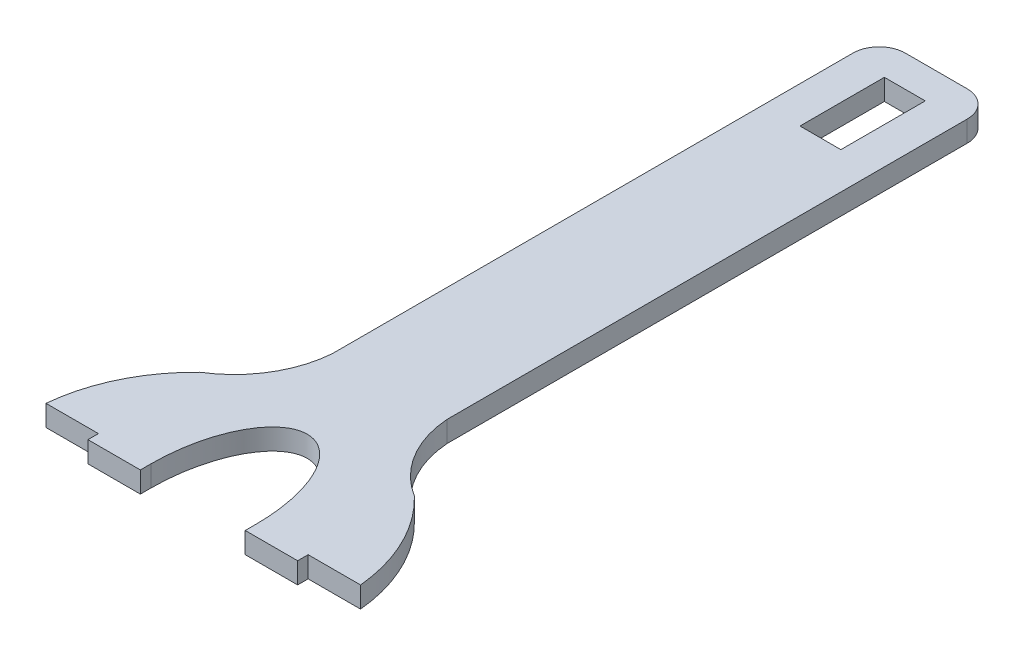
ISO-10303-21;
HEADER;
FILE_DESCRIPTION(('STEP AP214'),'2;1');
FILE_NAME('part.step','',(''),(''),'','','');
FILE_SCHEMA(('AUTOMOTIVE_DESIGN { 1 0 10303 214 1 1 1 1 }'));
ENDSEC;
DATA;
#1=APPLICATION_CONTEXT('core data for automotive mechanical design processes');
#2=APPLICATION_PROTOCOL_DEFINITION('international standard','automotive_design',2000,#1);
#3=PRODUCT_CONTEXT('',#1,'mechanical');
#4=PRODUCT('Part','Part','',(#3));
#5=PRODUCT_RELATED_PRODUCT_CATEGORY('part','',(#4));
#6=PRODUCT_DEFINITION_FORMATION('','',#4);
#7=PRODUCT_DEFINITION_CONTEXT('part definition',#1,'design');
#8=PRODUCT_DEFINITION('design','',#6,#7);
#9=PRODUCT_DEFINITION_SHAPE('','',#8);
#10=(LENGTH_UNIT() NAMED_UNIT(*) SI_UNIT(.MILLI.,.METRE.));
#11=(NAMED_UNIT(*) PLANE_ANGLE_UNIT() SI_UNIT($,.RADIAN.));
#12=(NAMED_UNIT(*) SI_UNIT($,.STERADIAN.) SOLID_ANGLE_UNIT());
#13=UNCERTAINTY_MEASURE_WITH_UNIT(LENGTH_MEASURE(1.E-05),#10,'distance_accuracy_value','');
#14=(GEOMETRIC_REPRESENTATION_CONTEXT(3) GLOBAL_UNCERTAINTY_ASSIGNED_CONTEXT((#13)) GLOBAL_UNIT_ASSIGNED_CONTEXT((#10,
#11,#12)) REPRESENTATION_CONTEXT('',''));
#15=CARTESIAN_POINT('',(0.,0.,0.));
#16=DIRECTION('',(0.,0.,1.));
#17=DIRECTION('',(1.,0.,0.));
#18=AXIS2_PLACEMENT_3D('',#15,#16,#17);
#19=CARTESIAN_POINT('',(79.9275443444036,10.16,7.48998109849393));
#20=DIRECTION('',(0.,-1.,0.));
#21=DIRECTION('',(0.,0.,-1.));
#22=AXIS2_PLACEMENT_3D('',#19,#20,#21);
#23=CYLINDRICAL_SURFACE('',#22,80.2777189622525);
#24=CARTESIAN_POINT('',(79.9275443444036,0.,7.48998109849393));
#25=DIRECTION('',(0.,1.,0.));
#26=DIRECTION('',(0.,0.,-1.));
#27=AXIS2_PLACEMENT_3D('',#24,#25,#26);
#28=CIRCLE('',#27,80.2777189622525);
#29=CARTESIAN_POINT('',(24.2571161506179,0.,-50.3487220897947));
#30=VERTEX_POINT('',#29);
#31=CARTESIAN_POINT('',(0.,0.,0.));
#32=VERTEX_POINT('',#31);
#33=EDGE_CURVE('E214',#30,#32,#28,.T.);
#34=ORIENTED_EDGE('',*,*,#33,.T.);
#35=DIRECTION('',(0.,-1.,0.));
#36=VECTOR('',#35,1.);
#37=CARTESIAN_POINT('',(0.,10.16,0.));
#38=LINE('',#37,#36);
#39=CARTESIAN_POINT('',(0.,10.16,0.));
#40=VERTEX_POINT('',#39);
#41=EDGE_CURVE('E11',#40,#32,#38,.T.);
#42=ORIENTED_EDGE('',*,*,#41,.F.);
#43=CARTESIAN_POINT('',(79.9275443444036,10.16,7.48998109849393));
#44=DIRECTION('',(0.,1.,0.));
#45=DIRECTION('',(0.,0.,-1.));
#46=AXIS2_PLACEMENT_3D('',#43,#44,#45);
#47=CIRCLE('',#46,80.2777189622525);
#48=CARTESIAN_POINT('',(24.2571161506179,10.16,-50.3487220897947));
#49=VERTEX_POINT('',#48);
#50=EDGE_CURVE('E218',#49,#40,#47,.T.);
#51=ORIENTED_EDGE('',*,*,#50,.F.);
#52=DIRECTION('',(0.,-1.,0.));
#53=VECTOR('',#52,1.);
#54=CARTESIAN_POINT('',(24.2571161506179,10.16,-50.3487220897947));
#55=LINE('',#54,#53);
#56=EDGE_CURVE('E308',#49,#30,#55,.T.);
#57=ORIENTED_EDGE('',*,*,#56,.T.);
#58=EDGE_LOOP('',(#34,#42,#51,#57));
#59=FACE_BOUND('',#58,.T.);
#60=ADVANCED_FACE('F33',(#59),#23,.T.);
#61=CARTESIAN_POINT('',(0.,10.16,0.));
#62=DIRECTION('',(0.,0.,-1.));
#63=DIRECTION('',(-1.,0.,0.));
#64=AXIS2_PLACEMENT_3D('',#61,#62,#63);
#65=PLANE('',#64);
#66=DIRECTION('',(1.,0.,0.));
#67=VECTOR('',#66,1.);
#68=CARTESIAN_POINT('',(0.,0.,0.));
#69=LINE('',#68,#67);
#70=CARTESIAN_POINT('',(25.4,0.,0.));
#71=VERTEX_POINT('',#70);
#72=EDGE_CURVE('E262',#32,#71,#69,.T.);
#73=ORIENTED_EDGE('',*,*,#72,.T.);
#74=DIRECTION('',(0.,-1.,0.));
#75=VECTOR('',#74,1.);
#76=CARTESIAN_POINT('',(25.4,10.16,0.));
#77=LINE('',#76,#75);
#78=CARTESIAN_POINT('',(25.4,10.16,0.));
#79=VERTEX_POINT('',#78);
#80=EDGE_CURVE('E40',#79,#71,#77,.T.);
#81=ORIENTED_EDGE('',*,*,#80,.F.);
#82=DIRECTION('',(1.,0.,0.));
#83=VECTOR('',#82,1.);
#84=CARTESIAN_POINT('',(0.,10.16,0.));
#85=LINE('',#84,#83);
#86=EDGE_CURVE('E221',#40,#79,#85,.T.);
#87=ORIENTED_EDGE('',*,*,#86,.F.);
#88=ORIENTED_EDGE('',*,*,#41,.T.);
#89=EDGE_LOOP('',(#73,#81,#87,#88));
#90=FACE_BOUND('',#89,.T.);
#91=ADVANCED_FACE('F253',(#90),#65,.F.);
#92=CARTESIAN_POINT('',(25.4,10.16,0.));
#93=DIRECTION('',(1.,0.,0.));
#94=DIRECTION('',(0.,0.,-1.));
#95=AXIS2_PLACEMENT_3D('',#92,#93,#94);
#96=PLANE('',#95);
#97=DIRECTION('',(0.,0.,1.));
#98=VECTOR('',#97,1.);
#99=CARTESIAN_POINT('',(25.4,0.,0.));
#100=LINE('',#99,#98);
#101=CARTESIAN_POINT('',(25.4,0.,5.08));
#102=VERTEX_POINT('',#101);
#103=EDGE_CURVE('E269',#71,#102,#100,.T.);
#104=ORIENTED_EDGE('',*,*,#103,.T.);
#105=DIRECTION('',(0.,-1.,0.));
#106=VECTOR('',#105,1.);
#107=CARTESIAN_POINT('',(25.4,10.16,5.08));
#108=LINE('',#107,#106);
#109=CARTESIAN_POINT('',(25.4,10.16,5.08));
#110=VERTEX_POINT('',#109);
#111=EDGE_CURVE('E273',#110,#102,#108,.T.);
#112=ORIENTED_EDGE('',*,*,#111,.F.);
#113=DIRECTION('',(0.,0.,1.));
#114=VECTOR('',#113,1.);
#115=CARTESIAN_POINT('',(25.4,10.16,0.));
#116=LINE('',#115,#114);
#117=EDGE_CURVE('E224',#79,#110,#116,.T.);
#118=ORIENTED_EDGE('',*,*,#117,.F.);
#119=ORIENTED_EDGE('',*,*,#80,.T.);
#120=EDGE_LOOP('',(#104,#112,#118,#119));
#121=FACE_BOUND('',#120,.T.);
#122=ADVANCED_FACE('F250',(#121),#96,.F.);
#123=CARTESIAN_POINT('',(25.4,10.16,5.08));
#124=DIRECTION('',(0.,0.,-1.));
#125=DIRECTION('',(-1.,0.,0.));
#126=AXIS2_PLACEMENT_3D('',#123,#124,#125);
#127=PLANE('',#126);
#128=DIRECTION('',(1.,0.,0.));
#129=VECTOR('',#128,1.);
#130=CARTESIAN_POINT('',(25.4,0.,5.08));
#131=LINE('',#130,#129);
#132=CARTESIAN_POINT('',(50.8,0.,5.08));
#133=VERTEX_POINT('',#132);
#134=EDGE_CURVE('E276',#102,#133,#131,.T.);
#135=ORIENTED_EDGE('',*,*,#134,.T.);
#136=DIRECTION('',(0.,-1.,0.));
#137=VECTOR('',#136,1.);
#138=CARTESIAN_POINT('',(50.8,10.16,5.08));
#139=LINE('',#138,#137);
#140=CARTESIAN_POINT('',(50.8,10.16,5.08));
#141=VERTEX_POINT('',#140);
#142=EDGE_CURVE('E351',#141,#133,#139,.T.);
#143=ORIENTED_EDGE('',*,*,#142,.F.);
#144=DIRECTION('',(1.,0.,0.));
#145=VECTOR('',#144,1.);
#146=CARTESIAN_POINT('',(25.4,10.16,5.08));
#147=LINE('',#146,#145);
#148=EDGE_CURVE('E226',#110,#141,#147,.T.);
#149=ORIENTED_EDGE('',*,*,#148,.F.);
#150=ORIENTED_EDGE('',*,*,#111,.T.);
#151=EDGE_LOOP('',(#135,#143,#149,#150));
#152=FACE_BOUND('',#151,.T.);
#153=ADVANCED_FACE('F246',(#152),#127,.F.);
#154=CARTESIAN_POINT('',(50.8,10.16,0.));
#155=DIRECTION('',(-1.,0.,0.));
#156=DIRECTION('',(0.,0.,1.));
#157=AXIS2_PLACEMENT_3D('',#154,#155,#156);
#158=PLANE('',#157);
#159=DIRECTION('',(0.,0.,-1.));
#160=VECTOR('',#159,1.);
#161=CARTESIAN_POINT('',(50.8,0.,0.));
#162=LINE('',#161,#160);
#163=CARTESIAN_POINT('',(50.8,0.,0.));
#164=VERTEX_POINT('',#163);
#165=EDGE_CURVE('E278',#133,#164,#162,.T.);
#166=ORIENTED_EDGE('',*,*,#165,.T.);
#167=DIRECTION('',(0.,-1.,0.));
#168=VECTOR('',#167,1.);
#169=CARTESIAN_POINT('',(50.8,10.16,0.));
#170=LINE('',#169,#168);
#171=CARTESIAN_POINT('',(50.8,10.16,0.));
#172=VERTEX_POINT('',#171);
#173=EDGE_CURVE('E348',#172,#164,#170,.T.);
#174=ORIENTED_EDGE('',*,*,#173,.F.);
#175=DIRECTION('',(0.,0.,-1.));
#176=VECTOR('',#175,1.);
#177=CARTESIAN_POINT('',(50.8,10.16,0.));
#178=LINE('',#177,#176);
#179=EDGE_CURVE('E228',#141,#172,#178,.T.);
#180=ORIENTED_EDGE('',*,*,#179,.F.);
#181=ORIENTED_EDGE('',*,*,#142,.T.);
#182=EDGE_LOOP('',(#166,#174,#180,#181));
#183=FACE_BOUND('',#182,.T.);
#184=ADVANCED_FACE('F241',(#183),#158,.F.);
#185=CARTESIAN_POINT('',(76.2,10.16,0.));
#186=DIRECTION('',(0.,-1.,0.));
#187=DIRECTION('',(0.,0.,-1.));
#188=AXIS2_PLACEMENT_3D('',#185,#186,#187);
#189=ELLIPSE('',#188,50.3487220897947,25.4);
#190=DIRECTION('',(0.,-1.,0.));
#191=VECTOR('',#190,1.);
#192=SURFACE_OF_LINEAR_EXTRUSION('',#189,#191);
#193=CARTESIAN_POINT('',(76.2,0.,0.));
#194=DIRECTION('',(0.,-1.,0.));
#195=DIRECTION('',(0.,0.,-1.));
#196=AXIS2_PLACEMENT_3D('',#193,#194,#195);
#197=ELLIPSE('',#196,50.3487220897947,25.4);
#198=CARTESIAN_POINT('',(101.6,0.,0.));
#199=VERTEX_POINT('',#198);
#200=EDGE_CURVE('E283',#164,#199,#197,.T.);
#201=ORIENTED_EDGE('',*,*,#200,.T.);
#202=DIRECTION('',(0.,-1.,0.));
#203=VECTOR('',#202,1.);
#204=CARTESIAN_POINT('',(101.6,10.16,0.));
#205=LINE('',#204,#203);
#206=CARTESIAN_POINT('',(101.6,10.16,0.));
#207=VERTEX_POINT('',#206);
#208=EDGE_CURVE('E345',#207,#199,#205,.T.);
#209=ORIENTED_EDGE('',*,*,#208,.F.);
#210=EDGE_CURVE('E230',#172,#207,#189,.T.);
#211=ORIENTED_EDGE('',*,*,#210,.F.);
#212=ORIENTED_EDGE('',*,*,#173,.T.);
#213=EDGE_LOOP('',(#201,#209,#211,#212));
#214=FACE_BOUND('',#213,.T.);
#215=ADVANCED_FACE('F236',(#214),#192,.F.);
#216=CARTESIAN_POINT('',(101.6,10.16,0.));
#217=DIRECTION('',(1.,0.,0.));
#218=DIRECTION('',(0.,0.,-1.));
#219=AXIS2_PLACEMENT_3D('',#216,#217,#218);
#220=PLANE('',#219);
#221=DIRECTION('',(0.,0.,1.));
#222=VECTOR('',#221,1.);
#223=CARTESIAN_POINT('',(101.6,0.,0.));
#224=LINE('',#223,#222);
#225=CARTESIAN_POINT('',(101.6,0.,5.08));
#226=VERTEX_POINT('',#225);
#227=EDGE_CURVE('E285',#199,#226,#224,.T.);
#228=ORIENTED_EDGE('',*,*,#227,.T.);
#229=DIRECTION('',(0.,-1.,0.));
#230=VECTOR('',#229,1.);
#231=CARTESIAN_POINT('',(101.6,10.16,5.08));
#232=LINE('',#231,#230);
#233=CARTESIAN_POINT('',(101.6,10.16,5.08));
#234=VERTEX_POINT('',#233);
#235=EDGE_CURVE('E342',#234,#226,#232,.T.);
#236=ORIENTED_EDGE('',*,*,#235,.F.);
#237=DIRECTION('',(0.,0.,1.));
#238=VECTOR('',#237,1.);
#239=CARTESIAN_POINT('',(101.6,10.16,0.));
#240=LINE('',#239,#238);
#241=EDGE_CURVE('E233',#207,#234,#240,.T.);
#242=ORIENTED_EDGE('',*,*,#241,.F.);
#243=ORIENTED_EDGE('',*,*,#208,.T.);
#244=EDGE_LOOP('',(#228,#236,#242,#243));
#245=FACE_BOUND('',#244,.T.);
#246=ADVANCED_FACE('F240',(#245),#220,.F.);
#247=CARTESIAN_POINT('',(127.,10.16,5.08));
#248=DIRECTION('',(0.,0.,-1.));
#249=DIRECTION('',(-1.,0.,0.));
#250=AXIS2_PLACEMENT_3D('',#247,#248,#249);
#251=PLANE('',#250);
#252=DIRECTION('',(1.,0.,0.));
#253=VECTOR('',#252,1.);
#254=CARTESIAN_POINT('',(127.,0.,5.08));
#255=LINE('',#254,#253);
#256=CARTESIAN_POINT('',(127.,0.,5.08));
#257=VERTEX_POINT('',#256);
#258=EDGE_CURVE('E287',#226,#257,#255,.T.);
#259=ORIENTED_EDGE('',*,*,#258,.T.);
#260=DIRECTION('',(0.,-1.,0.));
#261=VECTOR('',#260,1.);
#262=CARTESIAN_POINT('',(127.,10.16,5.08));
#263=LINE('',#262,#261);
#264=CARTESIAN_POINT('',(127.,10.16,5.08));
#265=VERTEX_POINT('',#264);
#266=EDGE_CURVE('E339',#265,#257,#263,.T.);
#267=ORIENTED_EDGE('',*,*,#266,.F.);
#268=DIRECTION('',(1.,0.,0.));
#269=VECTOR('',#268,1.);
#270=CARTESIAN_POINT('',(127.,10.16,5.08));
#271=LINE('',#270,#269);
#272=EDGE_CURVE('E383',#234,#265,#271,.T.);
#273=ORIENTED_EDGE('',*,*,#272,.F.);
#274=ORIENTED_EDGE('',*,*,#235,.T.);
#275=EDGE_LOOP('',(#259,#267,#273,#274));
#276=FACE_BOUND('',#275,.T.);
#277=ADVANCED_FACE('F394',(#276),#251,.F.);
#278=CARTESIAN_POINT('',(127.,10.16,0.));
#279=DIRECTION('',(-1.,0.,0.));
#280=DIRECTION('',(0.,0.,1.));
#281=AXIS2_PLACEMENT_3D('',#278,#279,#280);
#282=PLANE('',#281);
#283=DIRECTION('',(0.,0.,-1.));
#284=VECTOR('',#283,1.);
#285=CARTESIAN_POINT('',(127.,0.,0.));
#286=LINE('',#285,#284);
#287=CARTESIAN_POINT('',(127.,0.,0.));
#288=VERTEX_POINT('',#287);
#289=EDGE_CURVE('E289',#257,#288,#286,.T.);
#290=ORIENTED_EDGE('',*,*,#289,.T.);
#291=DIRECTION('',(0.,-1.,0.));
#292=VECTOR('',#291,1.);
#293=CARTESIAN_POINT('',(127.,10.16,0.));
#294=LINE('',#293,#292);
#295=CARTESIAN_POINT('',(127.,10.16,0.));
#296=VERTEX_POINT('',#295);
#297=EDGE_CURVE('E336',#296,#288,#294,.T.);
#298=ORIENTED_EDGE('',*,*,#297,.F.);
#299=DIRECTION('',(0.,0.,-1.));
#300=VECTOR('',#299,1.);
#301=CARTESIAN_POINT('',(127.,10.16,0.));
#302=LINE('',#301,#300);
#303=EDGE_CURVE('E382',#265,#296,#302,.T.);
#304=ORIENTED_EDGE('',*,*,#303,.F.);
#305=ORIENTED_EDGE('',*,*,#266,.T.);
#306=EDGE_LOOP('',(#290,#298,#304,#305));
#307=FACE_BOUND('',#306,.T.);
#308=ADVANCED_FACE('F399',(#307),#282,.F.);
#309=CARTESIAN_POINT('',(127.,10.16,0.));
#310=DIRECTION('',(0.,0.,-1.));
#311=DIRECTION('',(-1.,0.,0.));
#312=AXIS2_PLACEMENT_3D('',#309,#310,#311);
#313=PLANE('',#312);
#314=DIRECTION('',(1.,0.,0.));
#315=VECTOR('',#314,1.);
#316=CARTESIAN_POINT('',(127.,0.,0.));
#317=LINE('',#316,#315);
#318=CARTESIAN_POINT('',(152.4,0.,0.));
#319=VERTEX_POINT('',#318);
#320=EDGE_CURVE('E291',#288,#319,#317,.T.);
#321=ORIENTED_EDGE('',*,*,#320,.T.);
#322=DIRECTION('',(0.,-1.,0.));
#323=VECTOR('',#322,1.);
#324=CARTESIAN_POINT('',(152.4,10.16,0.));
#325=LINE('',#324,#323);
#326=CARTESIAN_POINT('',(152.4,10.16,0.));
#327=VERTEX_POINT('',#326);
#328=EDGE_CURVE('E333',#327,#319,#325,.T.);
#329=ORIENTED_EDGE('',*,*,#328,.F.);
#330=DIRECTION('',(1.,0.,0.));
#331=VECTOR('',#330,1.);
#332=CARTESIAN_POINT('',(127.,10.16,0.));
#333=LINE('',#332,#331);
#334=EDGE_CURVE('E380',#296,#327,#333,.T.);
#335=ORIENTED_EDGE('',*,*,#334,.F.);
#336=ORIENTED_EDGE('',*,*,#297,.T.);
#337=EDGE_LOOP('',(#321,#329,#335,#336));
#338=FACE_BOUND('',#337,.T.);
#339=ADVANCED_FACE('F405',(#338),#313,.F.);
#340=CARTESIAN_POINT('',(72.4724556555964,10.16,7.48998109849393));
#341=DIRECTION('',(0.,-1.,0.));
#342=DIRECTION('',(0.,0.,-1.));
#343=AXIS2_PLACEMENT_3D('',#340,#341,#342);
#344=CYLINDRICAL_SURFACE('',#343,80.2777189622525);
#345=CARTESIAN_POINT('',(72.4724556555964,0.,7.48998109849393));
#346=DIRECTION('',(0.,1.,0.));
#347=DIRECTION('',(0.,0.,1.));
#348=AXIS2_PLACEMENT_3D('',#345,#346,#347);
#349=CIRCLE('',#348,80.2777189622525);
#350=CARTESIAN_POINT('',(128.142883849382,0.,-50.3487220897947));
#351=VERTEX_POINT('',#350);
#352=EDGE_CURVE('E293',#319,#351,#349,.T.);
#353=ORIENTED_EDGE('',*,*,#352,.T.);
#354=DIRECTION('',(0.,-1.,0.));
#355=VECTOR('',#354,1.);
#356=CARTESIAN_POINT('',(128.142883849382,10.16,-50.3487220897947));
#357=LINE('',#356,#355);
#358=CARTESIAN_POINT('',(128.142883849382,10.16,-50.3487220897947));
#359=VERTEX_POINT('',#358);
#360=EDGE_CURVE('E330',#359,#351,#357,.T.);
#361=ORIENTED_EDGE('',*,*,#360,.F.);
#362=CARTESIAN_POINT('',(72.4724556555964,10.16,7.48998109849393));
#363=DIRECTION('',(0.,1.,0.));
#364=DIRECTION('',(0.,0.,1.));
#365=AXIS2_PLACEMENT_3D('',#362,#363,#364);
#366=CIRCLE('',#365,80.2777189622525);
#367=EDGE_CURVE('E378',#327,#359,#366,.T.);
#368=ORIENTED_EDGE('',*,*,#367,.F.);
#369=ORIENTED_EDGE('',*,*,#328,.T.);
#370=EDGE_LOOP('',(#353,#361,#368,#369));
#371=FACE_BOUND('',#370,.T.);
#372=ADVANCED_FACE('F409',(#371),#344,.T.);
#373=CARTESIAN_POINT('',(155.285384488534,10.16,-94.1638257290554));
#374=DIRECTION('',(0.,-1.,0.));
#375=DIRECTION('',(0.,0.,-1.));
#376=AXIS2_PLACEMENT_3D('',#373,#374,#375);
#377=CYLINDRICAL_SURFACE('',#376,51.5410384826065);
#378=CARTESIAN_POINT('',(155.285384488534,0.,-94.1638257290554));
#379=DIRECTION('',(0.,-1.,0.));
#380=DIRECTION('',(0.,0.,-1.));
#381=AXIS2_PLACEMENT_3D('',#378,#379,#380);
#382=CIRCLE('',#381,51.5410384826065);
#383=CARTESIAN_POINT('',(103.885767698764,0.,-90.3483255350681));
#384=VERTEX_POINT('',#383);
#385=EDGE_CURVE('E295',#351,#384,#382,.T.);
#386=ORIENTED_EDGE('',*,*,#385,.T.);
#387=DIRECTION('',(0.,-1.,0.));
#388=VECTOR('',#387,1.);
#389=CARTESIAN_POINT('',(103.885767698764,10.16,-90.3483255350681));
#390=LINE('',#389,#388);
#391=CARTESIAN_POINT('',(103.885767698764,10.16,-90.3483255350681));
#392=VERTEX_POINT('',#391);
#393=EDGE_CURVE('E327',#392,#384,#390,.T.);
#394=ORIENTED_EDGE('',*,*,#393,.F.);
#395=CARTESIAN_POINT('',(155.285384488534,10.16,-94.1638257290554));
#396=DIRECTION('',(0.,-1.,0.));
#397=DIRECTION('',(0.,0.,-1.));
#398=AXIS2_PLACEMENT_3D('',#395,#396,#397);
#399=CIRCLE('',#398,51.5410384826065);
#400=EDGE_CURVE('E376',#359,#392,#399,.T.);
#401=ORIENTED_EDGE('',*,*,#400,.F.);
#402=ORIENTED_EDGE('',*,*,#360,.T.);
#403=EDGE_LOOP('',(#386,#394,#401,#402));
#404=FACE_BOUND('',#403,.T.);
#405=ADVANCED_FACE('F414',(#404),#377,.F.);
#406=CARTESIAN_POINT('',(103.885767698764,10.16,-90.3483255350681));
#407=DIRECTION('',(-1.,0.,0.));
#408=DIRECTION('',(0.,0.,1.));
#409=AXIS2_PLACEMENT_3D('',#406,#407,#408);
#410=PLANE('',#409);
#411=DIRECTION('',(0.,0.,-1.));
#412=VECTOR('',#411,1.);
#413=CARTESIAN_POINT('',(103.885767698764,0.,-90.3483255350681));
#414=LINE('',#413,#412);
#415=CARTESIAN_POINT('',(103.885767698764,0.,-342.448722089795));
#416=VERTEX_POINT('',#415);
#417=EDGE_CURVE('E297',#384,#416,#414,.T.);
#418=ORIENTED_EDGE('',*,*,#417,.T.);
#419=DIRECTION('',(0.,-1.,0.));
#420=VECTOR('',#419,1.);
#421=CARTESIAN_POINT('',(103.885767698764,10.16,-342.448722089795));
#422=LINE('',#421,#420);
#423=CARTESIAN_POINT('',(103.885767698764,10.16,-342.448722089795));
#424=VERTEX_POINT('',#423);
#425=EDGE_CURVE('E324',#424,#416,#422,.T.);
#426=ORIENTED_EDGE('',*,*,#425,.F.);
#427=DIRECTION('',(0.,0.,-1.));
#428=VECTOR('',#427,1.);
#429=CARTESIAN_POINT('',(103.885767698764,10.16,-90.3483255350681));
#430=LINE('',#429,#428);
#431=EDGE_CURVE('E374',#392,#424,#430,.T.);
#432=ORIENTED_EDGE('',*,*,#431,.F.);
#433=ORIENTED_EDGE('',*,*,#393,.T.);
#434=EDGE_LOOP('',(#418,#426,#432,#433));
#435=FACE_BOUND('',#434,.T.);
#436=ADVANCED_FACE('F420',(#435),#410,.F.);
#437=CARTESIAN_POINT('',(91.1857676987642,10.16,-342.448722089795));
#438=DIRECTION('',(0.,-1.,0.));
#439=DIRECTION('',(0.,0.,-1.));
#440=AXIS2_PLACEMENT_3D('',#437,#438,#439);
#441=CYLINDRICAL_SURFACE('',#440,12.7);
#442=CARTESIAN_POINT('',(91.1857676987642,0.,-342.448722089795));
#443=DIRECTION('',(0.,1.,0.));
#444=DIRECTION('',(0.,0.,-1.));
#445=AXIS2_PLACEMENT_3D('',#442,#443,#444);
#446=CIRCLE('',#445,12.7);
#447=CARTESIAN_POINT('',(91.1857676987641,0.,-355.148722089795));
#448=VERTEX_POINT('',#447);
#449=EDGE_CURVE('E299',#416,#448,#446,.T.);
#450=ORIENTED_EDGE('',*,*,#449,.T.);
#451=DIRECTION('',(0.,-1.,0.));
#452=VECTOR('',#451,1.);
#453=CARTESIAN_POINT('',(91.1857676987641,10.16,-355.148722089795));
#454=LINE('',#453,#452);
#455=CARTESIAN_POINT('',(91.1857676987641,10.16,-355.148722089795));
#456=VERTEX_POINT('',#455);
#457=EDGE_CURVE('E321',#456,#448,#454,.T.);
#458=ORIENTED_EDGE('',*,*,#457,.F.);
#459=CARTESIAN_POINT('',(91.1857676987642,10.16,-342.448722089795));
#460=DIRECTION('',(0.,1.,0.));
#461=DIRECTION('',(0.,0.,-1.));
#462=AXIS2_PLACEMENT_3D('',#459,#460,#461);
#463=CIRCLE('',#462,12.7);
#464=EDGE_CURVE('E372',#424,#456,#463,.T.);
#465=ORIENTED_EDGE('',*,*,#464,.F.);
#466=ORIENTED_EDGE('',*,*,#425,.T.);
#467=EDGE_LOOP('',(#450,#458,#465,#466));
#468=FACE_BOUND('',#467,.T.);
#469=ADVANCED_FACE('F424',(#468),#441,.T.);
#470=CARTESIAN_POINT('',(61.2142323012359,10.16,-355.148722089795));
#471=DIRECTION('',(0.,0.,1.));
#472=DIRECTION('',(1.,0.,0.));
#473=AXIS2_PLACEMENT_3D('',#470,#471,#472);
#474=PLANE('',#473);
#475=DIRECTION('',(-1.,0.,0.));
#476=VECTOR('',#475,1.);
#477=CARTESIAN_POINT('',(61.2142323012359,0.,-355.148722089795));
#478=LINE('',#477,#476);
#479=CARTESIAN_POINT('',(61.2142323012359,0.,-355.148722089795));
#480=VERTEX_POINT('',#479);
#481=EDGE_CURVE('E301',#448,#480,#478,.T.);
#482=ORIENTED_EDGE('',*,*,#481,.T.);
#483=DIRECTION('',(0.,-1.,0.));
#484=VECTOR('',#483,1.);
#485=CARTESIAN_POINT('',(61.2142323012359,10.16,-355.148722089795));
#486=LINE('',#485,#484);
#487=CARTESIAN_POINT('',(61.2142323012359,10.16,-355.148722089795));
#488=VERTEX_POINT('',#487);
#489=EDGE_CURVE('E318',#488,#480,#486,.T.);
#490=ORIENTED_EDGE('',*,*,#489,.F.);
#491=DIRECTION('',(-1.,0.,0.));
#492=VECTOR('',#491,1.);
#493=CARTESIAN_POINT('',(61.2142323012359,10.16,-355.148722089795));
#494=LINE('',#493,#492);
#495=EDGE_CURVE('E370',#456,#488,#494,.T.);
#496=ORIENTED_EDGE('',*,*,#495,.F.);
#497=ORIENTED_EDGE('',*,*,#457,.T.);
#498=EDGE_LOOP('',(#482,#490,#496,#497));
#499=FACE_BOUND('',#498,.T.);
#500=ADVANCED_FACE('F429',(#499),#474,.F.);
#501=CARTESIAN_POINT('',(61.2142323012358,10.16,-342.448722089795));
#502=DIRECTION('',(0.,-1.,0.));
#503=DIRECTION('',(0.,0.,-1.));
#504=AXIS2_PLACEMENT_3D('',#501,#502,#503);
#505=CYLINDRICAL_SURFACE('',#504,12.7);
#506=CARTESIAN_POINT('',(61.2142323012358,0.,-342.448722089795));
#507=DIRECTION('',(0.,1.,0.));
#508=DIRECTION('',(0.,0.,-1.));
#509=AXIS2_PLACEMENT_3D('',#506,#507,#508);
#510=CIRCLE('',#509,12.7);
#511=CARTESIAN_POINT('',(48.5142323012358,0.,-342.448722089795));
#512=VERTEX_POINT('',#511);
#513=EDGE_CURVE('E303',#480,#512,#510,.T.);
#514=ORIENTED_EDGE('',*,*,#513,.T.);
#515=DIRECTION('',(0.,-1.,0.));
#516=VECTOR('',#515,1.);
#517=CARTESIAN_POINT('',(48.5142323012358,10.16,-342.448722089795));
#518=LINE('',#517,#516);
#519=CARTESIAN_POINT('',(48.5142323012358,10.16,-342.448722089795));
#520=VERTEX_POINT('',#519);
#521=EDGE_CURVE('E315',#520,#512,#518,.T.);
#522=ORIENTED_EDGE('',*,*,#521,.F.);
#523=CARTESIAN_POINT('',(61.2142323012358,10.16,-342.448722089795));
#524=DIRECTION('',(0.,1.,0.));
#525=DIRECTION('',(0.,0.,-1.));
#526=AXIS2_PLACEMENT_3D('',#523,#524,#525);
#527=CIRCLE('',#526,12.7);
#528=EDGE_CURVE('E368',#488,#520,#527,.T.);
#529=ORIENTED_EDGE('',*,*,#528,.F.);
#530=ORIENTED_EDGE('',*,*,#489,.T.);
#531=EDGE_LOOP('',(#514,#522,#529,#530));
#532=FACE_BOUND('',#531,.T.);
#533=ADVANCED_FACE('F435',(#532),#505,.T.);
#534=CARTESIAN_POINT('',(48.5142323012358,10.16,-90.3483255350681));
#535=DIRECTION('',(1.,0.,0.));
#536=DIRECTION('',(0.,0.,-1.));
#537=AXIS2_PLACEMENT_3D('',#534,#535,#536);
#538=PLANE('',#537);
#539=DIRECTION('',(0.,0.,1.));
#540=VECTOR('',#539,1.);
#541=CARTESIAN_POINT('',(48.5142323012358,0.,-90.3483255350681));
#542=LINE('',#541,#540);
#543=CARTESIAN_POINT('',(48.5142323012358,0.,-90.3483255350681));
#544=VERTEX_POINT('',#543);
#545=EDGE_CURVE('E305',#512,#544,#542,.T.);
#546=ORIENTED_EDGE('',*,*,#545,.T.);
#547=DIRECTION('',(0.,-1.,0.));
#548=VECTOR('',#547,1.);
#549=CARTESIAN_POINT('',(48.5142323012358,10.16,-90.3483255350681));
#550=LINE('',#549,#548);
#551=CARTESIAN_POINT('',(48.5142323012358,10.16,-90.3483255350681));
#552=VERTEX_POINT('',#551);
#553=EDGE_CURVE('E311',#552,#544,#550,.T.);
#554=ORIENTED_EDGE('',*,*,#553,.F.);
#555=DIRECTION('',(0.,0.,1.));
#556=VECTOR('',#555,1.);
#557=CARTESIAN_POINT('',(48.5142323012358,10.16,-90.3483255350681));
#558=LINE('',#557,#556);
#559=EDGE_CURVE('E366',#520,#552,#558,.T.);
#560=ORIENTED_EDGE('',*,*,#559,.F.);
#561=ORIENTED_EDGE('',*,*,#521,.T.);
#562=EDGE_LOOP('',(#546,#554,#560,#561));
#563=FACE_BOUND('',#562,.T.);
#564=ADVANCED_FACE('F439',(#563),#538,.F.);
#565=CARTESIAN_POINT('',(-2.88538448853415,10.16,-94.1638257290554));
#566=DIRECTION('',(0.,-1.,0.));
#567=DIRECTION('',(0.,0.,-1.));
#568=AXIS2_PLACEMENT_3D('',#565,#566,#567);
#569=CYLINDRICAL_SURFACE('',#568,51.5410384826065);
#570=CARTESIAN_POINT('',(-2.88538448853415,0.,-94.1638257290554));
#571=DIRECTION('',(0.,-1.,0.));
#572=DIRECTION('',(0.,0.,1.));
#573=AXIS2_PLACEMENT_3D('',#570,#571,#572);
#574=CIRCLE('',#573,51.5410384826065);
#575=EDGE_CURVE('E222',#544,#30,#574,.T.);
#576=ORIENTED_EDGE('',*,*,#575,.T.);
#577=ORIENTED_EDGE('',*,*,#56,.F.);
#578=CARTESIAN_POINT('',(-2.88538448853415,10.16,-94.1638257290554));
#579=DIRECTION('',(0.,-1.,0.));
#580=DIRECTION('',(0.,0.,1.));
#581=AXIS2_PLACEMENT_3D('',#578,#579,#580);
#582=CIRCLE('',#581,51.5410384826065);
#583=EDGE_CURVE('E312',#552,#49,#582,.T.);
#584=ORIENTED_EDGE('',*,*,#583,.F.);
#585=ORIENTED_EDGE('',*,*,#553,.T.);
#586=EDGE_LOOP('',(#576,#577,#584,#585));
#587=FACE_BOUND('',#586,.T.);
#588=ADVANCED_FACE('F441',(#587),#569,.F.);
#589=CARTESIAN_POINT('',(76.2,10.16,0.));
#590=DIRECTION('',(0.,1.,0.));
#591=DIRECTION('',(0.,0.,1.));
#592=AXIS2_PLACEMENT_3D('',#589,#590,#591);
#593=PLANE('',#592);
#594=DIRECTION('',(0.,0.,1.));
#595=VECTOR('',#594,1.);
#596=CARTESIAN_POINT('',(66.2942323012359,10.16,-299.014722089795));
#597=LINE('',#596,#595);
#598=CARTESIAN_POINT('',(66.2942323012359,10.16,-339.908722089795));
#599=VERTEX_POINT('',#598);
#600=CARTESIAN_POINT('',(66.2942323012359,10.16,-299.014722089795));
#601=VERTEX_POINT('',#600);
#602=EDGE_CURVE('E47',#599,#601,#597,.T.);
#603=ORIENTED_EDGE('',*,*,#602,.F.);
#604=DIRECTION('',(-1.,0.,0.));
#605=VECTOR('',#604,1.);
#606=CARTESIAN_POINT('',(86.1062323012358,10.16,-339.908722089795));
#607=LINE('',#606,#605);
#608=CARTESIAN_POINT('',(86.1062323012358,10.16,-339.908722089795));
#609=VERTEX_POINT('',#608);
#610=EDGE_CURVE('E199',#609,#599,#607,.T.);
#611=ORIENTED_EDGE('',*,*,#610,.F.);
#612=DIRECTION('',(0.,0.,-1.));
#613=VECTOR('',#612,1.);
#614=CARTESIAN_POINT('',(86.1062323012358,10.16,-299.014722089795));
#615=LINE('',#614,#613);
#616=CARTESIAN_POINT('',(86.1062323012358,10.16,-299.014722089795));
#617=VERTEX_POINT('',#616);
#618=EDGE_CURVE('E202',#617,#609,#615,.T.);
#619=ORIENTED_EDGE('',*,*,#618,.F.);
#620=DIRECTION('',(1.,0.,0.));
#621=VECTOR('',#620,1.);
#622=CARTESIAN_POINT('',(86.1062323012358,10.16,-299.014722089795));
#623=LINE('',#622,#621);
#624=EDGE_CURVE('E208',#601,#617,#623,.T.);
#625=ORIENTED_EDGE('',*,*,#624,.F.);
#626=EDGE_LOOP('',(#603,#611,#619,#625));
#627=FACE_BOUND('',#626,.T.);
#628=ORIENTED_EDGE('',*,*,#50,.T.);
#629=ORIENTED_EDGE('',*,*,#86,.T.);
#630=ORIENTED_EDGE('',*,*,#117,.T.);
#631=ORIENTED_EDGE('',*,*,#148,.T.);
#632=ORIENTED_EDGE('',*,*,#179,.T.);
#633=ORIENTED_EDGE('',*,*,#210,.T.);
#634=ORIENTED_EDGE('',*,*,#241,.T.);
#635=ORIENTED_EDGE('',*,*,#272,.T.);
#636=ORIENTED_EDGE('',*,*,#303,.T.);
#637=ORIENTED_EDGE('',*,*,#334,.T.);
#638=ORIENTED_EDGE('',*,*,#367,.T.);
#639=ORIENTED_EDGE('',*,*,#400,.T.);
#640=ORIENTED_EDGE('',*,*,#431,.T.);
#641=ORIENTED_EDGE('',*,*,#464,.T.);
#642=ORIENTED_EDGE('',*,*,#495,.T.);
#643=ORIENTED_EDGE('',*,*,#528,.T.);
#644=ORIENTED_EDGE('',*,*,#559,.T.);
#645=ORIENTED_EDGE('',*,*,#583,.T.);
#646=EDGE_LOOP('',(#628,#629,#630,#631,#632,#633,#634,#635,#636,#637,#638,#639,#640,#641,#642,
#643,#644,#645));
#647=FACE_BOUND('',#646,.T.);
#648=ADVANCED_FACE('F358',(#627,#647),#593,.T.);
#649=CARTESIAN_POINT('',(76.2,0.,0.));
#650=DIRECTION('',(0.,1.,0.));
#651=DIRECTION('',(0.,0.,1.));
#652=AXIS2_PLACEMENT_3D('',#649,#650,#651);
#653=PLANE('',#652);
#654=DIRECTION('',(-1.,0.,0.));
#655=VECTOR('',#654,1.);
#656=CARTESIAN_POINT('',(86.1062323012358,0.,-339.908722089795));
#657=LINE('',#656,#655);
#658=CARTESIAN_POINT('',(86.1062323012358,0.,-339.908722089795));
#659=VERTEX_POINT('',#658);
#660=CARTESIAN_POINT('',(66.2942323012359,0.,-339.908722089795));
#661=VERTEX_POINT('',#660);
#662=EDGE_CURVE('E189',#659,#661,#657,.T.);
#663=ORIENTED_EDGE('',*,*,#662,.T.);
#664=DIRECTION('',(0.,0.,1.));
#665=VECTOR('',#664,1.);
#666=CARTESIAN_POINT('',(66.2942323012359,0.,-299.014722089795));
#667=LINE('',#666,#665);
#668=CARTESIAN_POINT('',(66.2942323012359,0.,-299.014722089795));
#669=VERTEX_POINT('',#668);
#670=EDGE_CURVE('E183',#661,#669,#667,.T.);
#671=ORIENTED_EDGE('',*,*,#670,.T.);
#672=DIRECTION('',(1.,0.,0.));
#673=VECTOR('',#672,1.);
#674=CARTESIAN_POINT('',(86.1062323012358,0.,-299.014722089795));
#675=LINE('',#674,#673);
#676=CARTESIAN_POINT('',(86.1062323012358,0.,-299.014722089795));
#677=VERTEX_POINT('',#676);
#678=EDGE_CURVE('E192',#669,#677,#675,.T.);
#679=ORIENTED_EDGE('',*,*,#678,.T.);
#680=DIRECTION('',(0.,0.,-1.));
#681=VECTOR('',#680,1.);
#682=CARTESIAN_POINT('',(86.1062323012358,0.,-299.014722089795));
#683=LINE('',#682,#681);
#684=EDGE_CURVE('E55',#677,#659,#683,.T.);
#685=ORIENTED_EDGE('',*,*,#684,.T.);
#686=EDGE_LOOP('',(#663,#671,#679,#685));
#687=FACE_BOUND('',#686,.T.);
#688=ORIENTED_EDGE('',*,*,#33,.F.);
#689=ORIENTED_EDGE('',*,*,#575,.F.);
#690=ORIENTED_EDGE('',*,*,#545,.F.);
#691=ORIENTED_EDGE('',*,*,#513,.F.);
#692=ORIENTED_EDGE('',*,*,#481,.F.);
#693=ORIENTED_EDGE('',*,*,#449,.F.);
#694=ORIENTED_EDGE('',*,*,#417,.F.);
#695=ORIENTED_EDGE('',*,*,#385,.F.);
#696=ORIENTED_EDGE('',*,*,#352,.F.);
#697=ORIENTED_EDGE('',*,*,#320,.F.);
#698=ORIENTED_EDGE('',*,*,#289,.F.);
#699=ORIENTED_EDGE('',*,*,#258,.F.);
#700=ORIENTED_EDGE('',*,*,#227,.F.);
#701=ORIENTED_EDGE('',*,*,#200,.F.);
#702=ORIENTED_EDGE('',*,*,#165,.F.);
#703=ORIENTED_EDGE('',*,*,#134,.F.);
#704=ORIENTED_EDGE('',*,*,#103,.F.);
#705=ORIENTED_EDGE('',*,*,#72,.F.);
#706=EDGE_LOOP('',(#688,#689,#690,#691,#692,#693,#694,#695,#696,#697,#698,#699,#700,#701,#702,
#703,#704,#705));
#707=FACE_BOUND('',#706,.T.);
#708=ADVANCED_FACE('F196',(#687,#707),#653,.F.);
#709=CARTESIAN_POINT('',(66.2942323012359,0.,-299.014722089795));
#710=DIRECTION('',(-1.,0.,0.));
#711=DIRECTION('',(0.,0.,1.));
#712=AXIS2_PLACEMENT_3D('',#709,#710,#711);
#713=PLANE('',#712);
#714=ORIENTED_EDGE('',*,*,#602,.T.);
#715=DIRECTION('',(0.,1.,0.));
#716=VECTOR('',#715,1.);
#717=CARTESIAN_POINT('',(66.2942323012359,0.,-299.014722089795));
#718=LINE('',#717,#716);
#719=EDGE_CURVE('E179',#669,#601,#718,.T.);
#720=ORIENTED_EDGE('',*,*,#719,.F.);
#721=ORIENTED_EDGE('',*,*,#670,.F.);
#722=DIRECTION('',(0.,1.,0.));
#723=VECTOR('',#722,1.);
#724=CARTESIAN_POINT('',(66.2942323012359,0.,-339.908722089795));
#725=LINE('',#724,#723);
#726=EDGE_CURVE('E212',#661,#599,#725,.T.);
#727=ORIENTED_EDGE('',*,*,#726,.T.);
#728=EDGE_LOOP('',(#714,#720,#721,#727));
#729=FACE_BOUND('',#728,.T.);
#730=ADVANCED_FACE('F181',(#729),#713,.F.);
#731=CARTESIAN_POINT('',(86.1062323012358,0.,-339.908722089795));
#732=DIRECTION('',(0.,0.,-1.));
#733=DIRECTION('',(-1.,0.,0.));
#734=AXIS2_PLACEMENT_3D('',#731,#732,#733);
#735=PLANE('',#734);
#736=ORIENTED_EDGE('',*,*,#610,.T.);
#737=ORIENTED_EDGE('',*,*,#726,.F.);
#738=ORIENTED_EDGE('',*,*,#662,.F.);
#739=DIRECTION('',(0.,1.,0.));
#740=VECTOR('',#739,1.);
#741=CARTESIAN_POINT('',(86.1062323012358,0.,-339.908722089795));
#742=LINE('',#741,#740);
#743=EDGE_CURVE('E215',#659,#609,#742,.T.);
#744=ORIENTED_EDGE('',*,*,#743,.T.);
#745=EDGE_LOOP('',(#736,#737,#738,#744));
#746=FACE_BOUND('',#745,.T.);
#747=ADVANCED_FACE('F583',(#746),#735,.F.);
#748=CARTESIAN_POINT('',(86.1062323012358,0.,-299.014722089795));
#749=DIRECTION('',(1.,0.,0.));
#750=DIRECTION('',(0.,0.,-1.));
#751=AXIS2_PLACEMENT_3D('',#748,#749,#750);
#752=PLANE('',#751);
#753=ORIENTED_EDGE('',*,*,#618,.T.);
#754=ORIENTED_EDGE('',*,*,#743,.F.);
#755=ORIENTED_EDGE('',*,*,#684,.F.);
#756=DIRECTION('',(0.,1.,0.));
#757=VECTOR('',#756,1.);
#758=CARTESIAN_POINT('',(86.1062323012358,0.,-299.014722089795));
#759=LINE('',#758,#757);
#760=EDGE_CURVE('E188',#677,#617,#759,.T.);
#761=ORIENTED_EDGE('',*,*,#760,.T.);
#762=EDGE_LOOP('',(#753,#754,#755,#761));
#763=FACE_BOUND('',#762,.T.);
#764=ADVANCED_FACE('F591',(#763),#752,.F.);
#765=CARTESIAN_POINT('',(86.1062323012358,0.,-299.014722089795));
#766=DIRECTION('',(0.,0.,1.));
#767=DIRECTION('',(1.,0.,0.));
#768=AXIS2_PLACEMENT_3D('',#765,#766,#767);
#769=PLANE('',#768);
#770=ORIENTED_EDGE('',*,*,#624,.T.);
#771=ORIENTED_EDGE('',*,*,#760,.F.);
#772=ORIENTED_EDGE('',*,*,#678,.F.);
#773=ORIENTED_EDGE('',*,*,#719,.T.);
#774=EDGE_LOOP('',(#770,#771,#772,#773));
#775=FACE_BOUND('',#774,.T.);
#776=ADVANCED_FACE('F193',(#775),#769,.F.);
#777=CLOSED_SHELL('',(#60,#91,#122,#153,#184,#215,#246,#277,#308,#339,#372,#405,#436,#469,#500,
#533,#564,#588,#648,#708,#730,#747,#764,#776));
#778=MANIFOLD_SOLID_BREP('B2',#777);
#779=ADVANCED_BREP_SHAPE_REPRESENTATION('',(#18,#778),#14);
#780=SHAPE_DEFINITION_REPRESENTATION(#9,#779);
ENDSEC;
END-ISO-10303-21;
